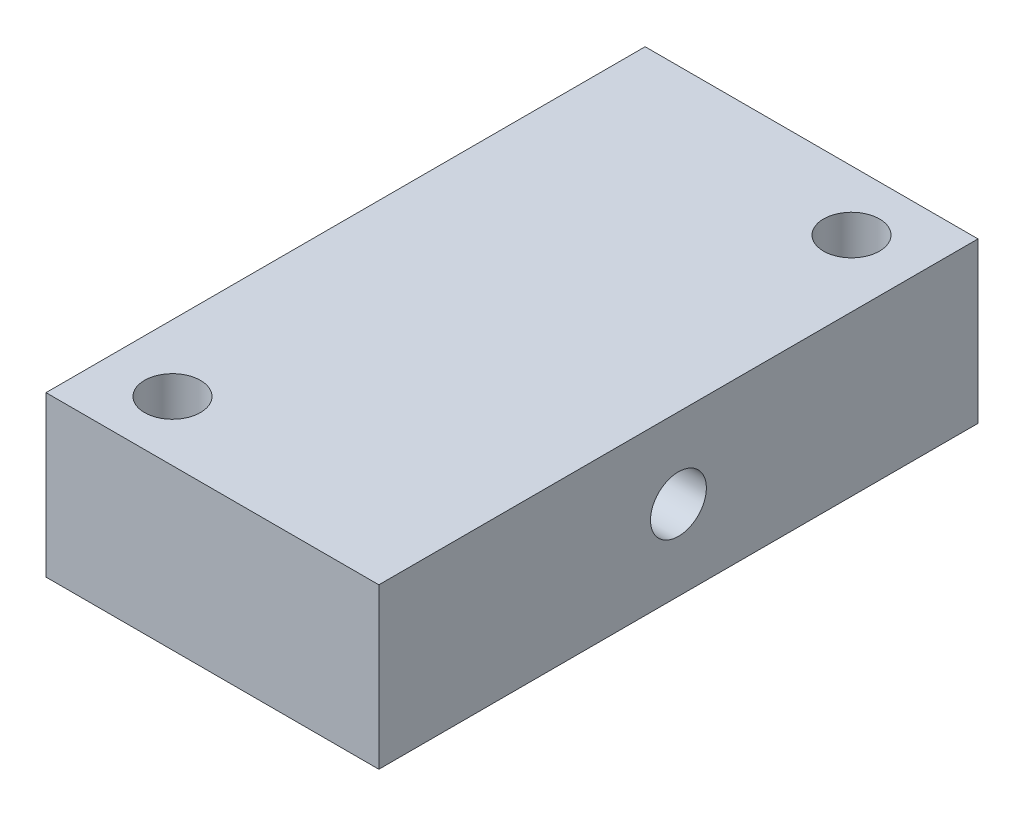
ISO-10303-21;
HEADER;
FILE_DESCRIPTION(('STEP AP214'),'2;1');
FILE_NAME('part.step','',(''),(''),'','','');
FILE_SCHEMA(('AUTOMOTIVE_DESIGN { 1 0 10303 214 1 1 1 1 }'));
ENDSEC;
DATA;
#1=APPLICATION_CONTEXT('core data for automotive mechanical design processes');
#2=APPLICATION_PROTOCOL_DEFINITION('international standard','automotive_design',2000,#1);
#3=PRODUCT_CONTEXT('',#1,'mechanical');
#4=PRODUCT('Part','Part','',(#3));
#5=PRODUCT_RELATED_PRODUCT_CATEGORY('part','',(#4));
#6=PRODUCT_DEFINITION_FORMATION('','',#4);
#7=PRODUCT_DEFINITION_CONTEXT('part definition',#1,'design');
#8=PRODUCT_DEFINITION('design','',#6,#7);
#9=PRODUCT_DEFINITION_SHAPE('','',#8);
#10=(LENGTH_UNIT() NAMED_UNIT(*) SI_UNIT(.MILLI.,.METRE.));
#11=(NAMED_UNIT(*) PLANE_ANGLE_UNIT() SI_UNIT($,.RADIAN.));
#12=(NAMED_UNIT(*) SI_UNIT($,.STERADIAN.) SOLID_ANGLE_UNIT());
#13=UNCERTAINTY_MEASURE_WITH_UNIT(LENGTH_MEASURE(1.E-05),#10,'distance_accuracy_value','');
#14=(GEOMETRIC_REPRESENTATION_CONTEXT(3) GLOBAL_UNCERTAINTY_ASSIGNED_CONTEXT((#13)) GLOBAL_UNIT_ASSIGNED_CONTEXT((#10,
#11,#12)) REPRESENTATION_CONTEXT('',''));
#15=CARTESIAN_POINT('',(0.,0.,0.));
#16=DIRECTION('',(0.,0.,1.));
#17=DIRECTION('',(1.,0.,0.));
#18=AXIS2_PLACEMENT_3D('',#15,#16,#17);
#19=CARTESIAN_POINT('',(12.5,12.,22.5));
#20=DIRECTION('',(-1.,0.,0.));
#21=DIRECTION('',(0.,0.,1.));
#22=AXIS2_PLACEMENT_3D('',#19,#20,#21);
#23=PLANE('',#22);
#24=CARTESIAN_POINT('',(12.5,6.00000000000009,0.));
#25=DIRECTION('',(1.,0.,0.));
#26=DIRECTION('',(0.,0.,-1.));
#27=AXIS2_PLACEMENT_3D('',#24,#25,#26);
#28=CIRCLE('',#27,2.09999999999999);
#29=CARTESIAN_POINT('',(12.5,6.00000000000009,-2.09999999999999));
#30=VERTEX_POINT('',#29);
#31=EDGE_CURVE('E153',#30,#30,#28,.T.);
#32=ORIENTED_EDGE('',*,*,#31,.F.);
#33=EDGE_LOOP('',(#32));
#34=FACE_BOUND('',#33,.T.);
#35=DIRECTION('',(0.,0.,-1.));
#36=VECTOR('',#35,1.);
#37=CARTESIAN_POINT('',(12.5,0.,22.5));
#38=LINE('',#37,#36);
#39=CARTESIAN_POINT('',(12.5,0.,22.5));
#40=VERTEX_POINT('',#39);
#41=CARTESIAN_POINT('',(12.5,0.,-22.5));
#42=VERTEX_POINT('',#41);
#43=EDGE_CURVE('E113',#40,#42,#38,.T.);
#44=ORIENTED_EDGE('',*,*,#43,.T.);
#45=DIRECTION('',(0.,-1.,0.));
#46=VECTOR('',#45,1.);
#47=CARTESIAN_POINT('',(12.5,12.,-22.5));
#48=LINE('',#47,#46);
#49=CARTESIAN_POINT('',(12.5,12.,-22.5));
#50=VERTEX_POINT('',#49);
#51=EDGE_CURVE('E11',#50,#42,#48,.T.);
#52=ORIENTED_EDGE('',*,*,#51,.F.);
#53=DIRECTION('',(0.,0.,-1.));
#54=VECTOR('',#53,1.);
#55=CARTESIAN_POINT('',(12.5,12.,22.5));
#56=LINE('',#55,#54);
#57=CARTESIAN_POINT('',(12.5,12.,22.5));
#58=VERTEX_POINT('',#57);
#59=EDGE_CURVE('E97',#58,#50,#56,.T.);
#60=ORIENTED_EDGE('',*,*,#59,.F.);
#61=DIRECTION('',(0.,-1.,0.));
#62=VECTOR('',#61,1.);
#63=CARTESIAN_POINT('',(12.5,12.,22.5));
#64=LINE('',#63,#62);
#65=EDGE_CURVE('E109',#58,#40,#64,.T.);
#66=ORIENTED_EDGE('',*,*,#65,.T.);
#67=EDGE_LOOP('',(#44,#52,#60,#66));
#68=FACE_BOUND('',#67,.T.);
#69=ADVANCED_FACE('F45',(#34,#68),#23,.F.);
#70=CARTESIAN_POINT('',(-12.5,12.,-22.5));
#71=DIRECTION('',(0.,0.,1.));
#72=DIRECTION('',(1.,0.,0.));
#73=AXIS2_PLACEMENT_3D('',#70,#71,#72);
#74=PLANE('',#73);
#75=DIRECTION('',(-1.,0.,0.));
#76=VECTOR('',#75,1.);
#77=CARTESIAN_POINT('',(-12.5,0.,-22.5));
#78=LINE('',#77,#76);
#79=CARTESIAN_POINT('',(-12.5,0.,-22.5));
#80=VERTEX_POINT('',#79);
#81=EDGE_CURVE('E102',#42,#80,#78,.T.);
#82=ORIENTED_EDGE('',*,*,#81,.T.);
#83=DIRECTION('',(0.,-1.,0.));
#84=VECTOR('',#83,1.);
#85=CARTESIAN_POINT('',(-12.5,12.,-22.5));
#86=LINE('',#85,#84);
#87=CARTESIAN_POINT('',(-12.5,12.,-22.5));
#88=VERTEX_POINT('',#87);
#89=EDGE_CURVE('E54',#88,#80,#86,.T.);
#90=ORIENTED_EDGE('',*,*,#89,.F.);
#91=DIRECTION('',(-1.,0.,0.));
#92=VECTOR('',#91,1.);
#93=CARTESIAN_POINT('',(-12.5,12.,-22.5));
#94=LINE('',#93,#92);
#95=EDGE_CURVE('E92',#50,#88,#94,.T.);
#96=ORIENTED_EDGE('',*,*,#95,.F.);
#97=ORIENTED_EDGE('',*,*,#51,.T.);
#98=EDGE_LOOP('',(#82,#90,#96,#97));
#99=FACE_BOUND('',#98,.T.);
#100=ADVANCED_FACE('F101',(#99),#74,.F.);
#101=CARTESIAN_POINT('',(-12.5,12.,22.5));
#102=DIRECTION('',(1.,0.,0.));
#103=DIRECTION('',(0.,0.,-1.));
#104=AXIS2_PLACEMENT_3D('',#101,#102,#103);
#105=PLANE('',#104);
#106=CARTESIAN_POINT('',(-12.5,6.00000000000009,0.));
#107=DIRECTION('',(1.,0.,0.));
#108=DIRECTION('',(0.,0.,-1.));
#109=AXIS2_PLACEMENT_3D('',#106,#107,#108);
#110=CIRCLE('',#109,2.1);
#111=CARTESIAN_POINT('',(-12.5,6.00000000000009,-2.1));
#112=VERTEX_POINT('',#111);
#113=EDGE_CURVE('E149',#112,#112,#110,.T.);
#114=ORIENTED_EDGE('',*,*,#113,.T.);
#115=EDGE_LOOP('',(#114));
#116=FACE_BOUND('',#115,.T.);
#117=DIRECTION('',(0.,0.,1.));
#118=VECTOR('',#117,1.);
#119=CARTESIAN_POINT('',(-12.5,0.,22.5));
#120=LINE('',#119,#118);
#121=CARTESIAN_POINT('',(-12.5,0.,22.5));
#122=VERTEX_POINT('',#121);
#123=EDGE_CURVE('E79',#80,#122,#120,.T.);
#124=ORIENTED_EDGE('',*,*,#123,.T.);
#125=DIRECTION('',(0.,-1.,0.));
#126=VECTOR('',#125,1.);
#127=CARTESIAN_POINT('',(-12.5,12.,22.5));
#128=LINE('',#127,#126);
#129=CARTESIAN_POINT('',(-12.5,12.,22.5));
#130=VERTEX_POINT('',#129);
#131=EDGE_CURVE('E104',#130,#122,#128,.T.);
#132=ORIENTED_EDGE('',*,*,#131,.F.);
#133=DIRECTION('',(0.,0.,1.));
#134=VECTOR('',#133,1.);
#135=CARTESIAN_POINT('',(-12.5,12.,22.5));
#136=LINE('',#135,#134);
#137=EDGE_CURVE('E95',#88,#130,#136,.T.);
#138=ORIENTED_EDGE('',*,*,#137,.F.);
#139=ORIENTED_EDGE('',*,*,#89,.T.);
#140=EDGE_LOOP('',(#124,#132,#138,#139));
#141=FACE_BOUND('',#140,.T.);
#142=ADVANCED_FACE('F105',(#116,#141),#105,.F.);
#143=CARTESIAN_POINT('',(-12.5,12.,22.5));
#144=DIRECTION('',(0.,0.,-1.));
#145=DIRECTION('',(-1.,0.,0.));
#146=AXIS2_PLACEMENT_3D('',#143,#144,#145);
#147=PLANE('',#146);
#148=DIRECTION('',(1.,0.,0.));
#149=VECTOR('',#148,1.);
#150=CARTESIAN_POINT('',(-12.5,0.,22.5));
#151=LINE('',#150,#149);
#152=EDGE_CURVE('E85',#122,#40,#151,.T.);
#153=ORIENTED_EDGE('',*,*,#152,.T.);
#154=ORIENTED_EDGE('',*,*,#65,.F.);
#155=DIRECTION('',(1.,0.,0.));
#156=VECTOR('',#155,1.);
#157=CARTESIAN_POINT('',(-12.5,12.,22.5));
#158=LINE('',#157,#156);
#159=EDGE_CURVE('E62',#130,#58,#158,.T.);
#160=ORIENTED_EDGE('',*,*,#159,.F.);
#161=ORIENTED_EDGE('',*,*,#131,.T.);
#162=EDGE_LOOP('',(#153,#154,#160,#161));
#163=FACE_BOUND('',#162,.T.);
#164=ADVANCED_FACE('F127',(#163),#147,.F.);
#165=CARTESIAN_POINT('',(0.,12.,0.));
#166=DIRECTION('',(0.,-1.,0.));
#167=DIRECTION('',(0.,0.,-1.));
#168=AXIS2_PLACEMENT_3D('',#165,#166,#167);
#169=PLANE('',#168);
#170=CARTESIAN_POINT('',(7.5,12.,-18.));
#171=DIRECTION('',(0.,1.,0.));
#172=DIRECTION('',(0.,0.,1.));
#173=AXIS2_PLACEMENT_3D('',#170,#171,#172);
#174=CIRCLE('',#173,2.09999999999999);
#175=CARTESIAN_POINT('',(7.5,12.,-15.9));
#176=VERTEX_POINT('',#175);
#177=EDGE_CURVE('E145',#176,#176,#174,.T.);
#178=ORIENTED_EDGE('',*,*,#177,.F.);
#179=EDGE_LOOP('',(#178));
#180=FACE_BOUND('',#179,.T.);
#181=CARTESIAN_POINT('',(-7.5,12.,18.));
#182=DIRECTION('',(0.,1.,0.));
#183=DIRECTION('',(0.,0.,1.));
#184=AXIS2_PLACEMENT_3D('',#181,#182,#183);
#185=CIRCLE('',#184,2.09999999999999);
#186=CARTESIAN_POINT('',(-7.5,12.,20.1));
#187=VERTEX_POINT('',#186);
#188=EDGE_CURVE('E137',#187,#187,#185,.T.);
#189=ORIENTED_EDGE('',*,*,#188,.F.);
#190=EDGE_LOOP('',(#189));
#191=FACE_BOUND('',#190,.T.);
#192=ORIENTED_EDGE('',*,*,#59,.T.);
#193=ORIENTED_EDGE('',*,*,#95,.T.);
#194=ORIENTED_EDGE('',*,*,#137,.T.);
#195=ORIENTED_EDGE('',*,*,#159,.T.);
#196=EDGE_LOOP('',(#192,#193,#194,#195));
#197=FACE_BOUND('',#196,.T.);
#198=ADVANCED_FACE('F93',(#180,#191,#197),#169,.F.);
#199=CARTESIAN_POINT('',(0.,0.,0.));
#200=DIRECTION('',(0.,-1.,0.));
#201=DIRECTION('',(0.,0.,-1.));
#202=AXIS2_PLACEMENT_3D('',#199,#200,#201);
#203=PLANE('',#202);
#204=CARTESIAN_POINT('',(7.5,0.,-18.));
#205=DIRECTION('',(0.,1.,0.));
#206=DIRECTION('',(0.,0.,1.));
#207=AXIS2_PLACEMENT_3D('',#204,#205,#206);
#208=CIRCLE('',#207,2.1);
#209=CARTESIAN_POINT('',(7.5,0.,-15.9));
#210=VERTEX_POINT('',#209);
#211=EDGE_CURVE('E141',#210,#210,#208,.T.);
#212=ORIENTED_EDGE('',*,*,#211,.T.);
#213=EDGE_LOOP('',(#212));
#214=FACE_BOUND('',#213,.T.);
#215=CARTESIAN_POINT('',(-7.5,0.,18.));
#216=DIRECTION('',(0.,1.,0.));
#217=DIRECTION('',(0.,0.,1.));
#218=AXIS2_PLACEMENT_3D('',#215,#216,#217);
#219=CIRCLE('',#218,2.1);
#220=CARTESIAN_POINT('',(-7.5,0.,20.1));
#221=VERTEX_POINT('',#220);
#222=EDGE_CURVE('E117',#221,#221,#219,.T.);
#223=ORIENTED_EDGE('',*,*,#222,.T.);
#224=EDGE_LOOP('',(#223));
#225=FACE_BOUND('',#224,.T.);
#226=ORIENTED_EDGE('',*,*,#43,.F.);
#227=ORIENTED_EDGE('',*,*,#152,.F.);
#228=ORIENTED_EDGE('',*,*,#123,.F.);
#229=ORIENTED_EDGE('',*,*,#81,.F.);
#230=EDGE_LOOP('',(#226,#227,#228,#229));
#231=FACE_BOUND('',#230,.T.);
#232=ADVANCED_FACE('F130',(#214,#225,#231),#203,.T.);
#233=CARTESIAN_POINT('',(-7.5,12.,18.));
#234=DIRECTION('',(0.,1.,0.));
#235=DIRECTION('',(0.,0.,1.));
#236=AXIS2_PLACEMENT_3D('',#233,#234,#235);
#237=CYLINDRICAL_SURFACE('',#236,2.09999999999999);
#238=ORIENTED_EDGE('',*,*,#222,.F.);
#239=EDGE_LOOP('',(#238));
#240=FACE_BOUND('',#239,.T.);
#241=ORIENTED_EDGE('',*,*,#188,.T.);
#242=EDGE_LOOP('',(#241));
#243=FACE_BOUND('',#242,.T.);
#244=ADVANCED_FACE('F174',(#240,#243),#237,.F.);
#245=CARTESIAN_POINT('',(7.5,12.,-18.));
#246=DIRECTION('',(0.,1.,0.));
#247=DIRECTION('',(0.,0.,1.));
#248=AXIS2_PLACEMENT_3D('',#245,#246,#247);
#249=CYLINDRICAL_SURFACE('',#248,2.09999999999999);
#250=ORIENTED_EDGE('',*,*,#211,.F.);
#251=EDGE_LOOP('',(#250));
#252=FACE_BOUND('',#251,.T.);
#253=ORIENTED_EDGE('',*,*,#177,.T.);
#254=EDGE_LOOP('',(#253));
#255=FACE_BOUND('',#254,.T.);
#256=ADVANCED_FACE('F181',(#252,#255),#249,.F.);
#257=CARTESIAN_POINT('',(12.5,6.00000000000009,0.));
#258=DIRECTION('',(1.,0.,0.));
#259=DIRECTION('',(0.,0.,-1.));
#260=AXIS2_PLACEMENT_3D('',#257,#258,#259);
#261=CYLINDRICAL_SURFACE('',#260,2.09999999999999);
#262=ORIENTED_EDGE('',*,*,#113,.F.);
#263=EDGE_LOOP('',(#262));
#264=FACE_BOUND('',#263,.T.);
#265=ORIENTED_EDGE('',*,*,#31,.T.);
#266=EDGE_LOOP('',(#265));
#267=FACE_BOUND('',#266,.T.);
#268=ADVANCED_FACE('F158',(#264,#267),#261,.F.);
#269=CLOSED_SHELL('',(#69,#100,#142,#164,#198,#232,#244,#256,#268));
#270=MANIFOLD_SOLID_BREP('B2',#269);
#271=ADVANCED_BREP_SHAPE_REPRESENTATION('',(#18,#270),#14);
#272=SHAPE_DEFINITION_REPRESENTATION(#9,#271);
ENDSEC;
END-ISO-10303-21;
